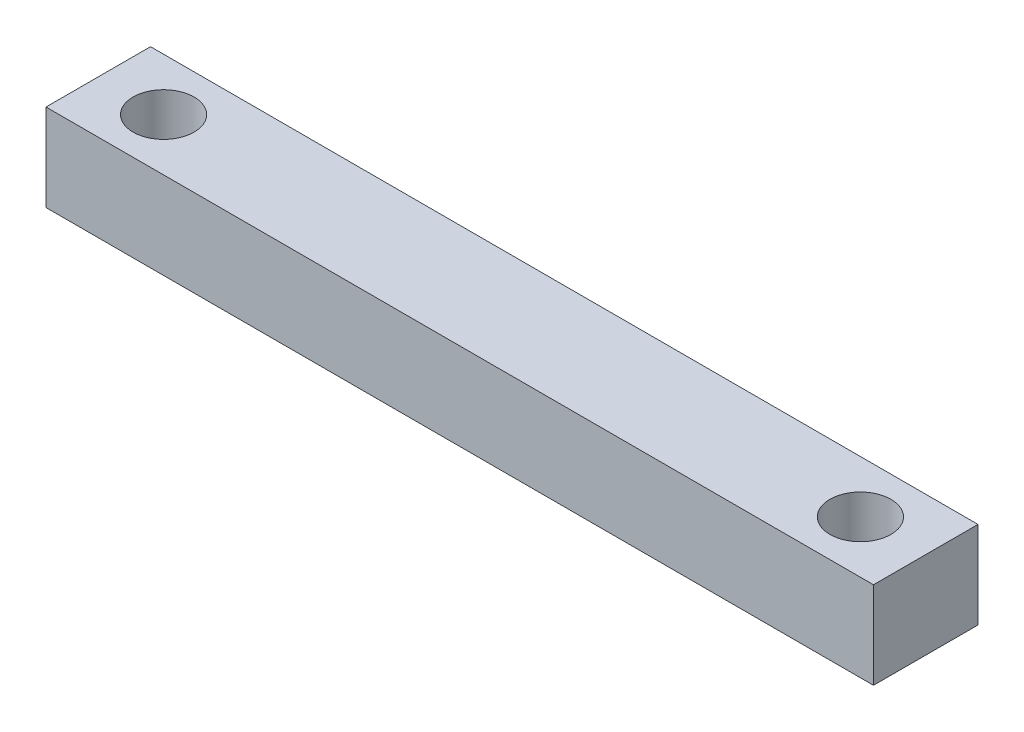
ISO-10303-21;
HEADER;
FILE_DESCRIPTION(('STEP AP214'),'2;1');
FILE_NAME('part.step','',(''),(''),'','','');
FILE_SCHEMA(('AUTOMOTIVE_DESIGN { 1 0 10303 214 1 1 1 1 }'));
ENDSEC;
DATA;
#1=APPLICATION_CONTEXT('core data for automotive mechanical design processes');
#2=APPLICATION_PROTOCOL_DEFINITION('international standard','automotive_design',2000,#1);
#3=PRODUCT_CONTEXT('',#1,'mechanical');
#4=PRODUCT('Part','Part','',(#3));
#5=PRODUCT_RELATED_PRODUCT_CATEGORY('part','',(#4));
#6=PRODUCT_DEFINITION_FORMATION('','',#4);
#7=PRODUCT_DEFINITION_CONTEXT('part definition',#1,'design');
#8=PRODUCT_DEFINITION('design','',#6,#7);
#9=PRODUCT_DEFINITION_SHAPE('','',#8);
#10=(LENGTH_UNIT() NAMED_UNIT(*) SI_UNIT(.MILLI.,.METRE.));
#11=(NAMED_UNIT(*) PLANE_ANGLE_UNIT() SI_UNIT($,.RADIAN.));
#12=(NAMED_UNIT(*) SI_UNIT($,.STERADIAN.) SOLID_ANGLE_UNIT());
#13=UNCERTAINTY_MEASURE_WITH_UNIT(LENGTH_MEASURE(1.E-05),#10,'distance_accuracy_value','');
#14=(GEOMETRIC_REPRESENTATION_CONTEXT(3) GLOBAL_UNCERTAINTY_ASSIGNED_CONTEXT((#13)) GLOBAL_UNIT_ASSIGNED_CONTEXT((#10,
#11,#12)) REPRESENTATION_CONTEXT('',''));
#15=CARTESIAN_POINT('',(0.,0.,0.));
#16=DIRECTION('',(0.,0.,1.));
#17=DIRECTION('',(1.,0.,0.));
#18=AXIS2_PLACEMENT_3D('',#15,#16,#17);
#19=CARTESIAN_POINT('',(0.,5.,0.));
#20=DIRECTION('',(0.,-1.,0.));
#21=DIRECTION('',(0.,0.,-1.));
#22=AXIS2_PLACEMENT_3D('',#19,#20,#21);
#23=PLANE('',#22);
#24=DIRECTION('',(0.,0.,-1.));
#25=VECTOR('',#24,1.);
#26=CARTESIAN_POINT('',(23.75,5.,3.));
#27=LINE('',#26,#25);
#28=CARTESIAN_POINT('',(23.75,5.,3.));
#29=VERTEX_POINT('',#28);
#30=CARTESIAN_POINT('',(23.75,5.,-3.));
#31=VERTEX_POINT('',#30);
#32=EDGE_CURVE('E95',#29,#31,#27,.T.);
#33=ORIENTED_EDGE('',*,*,#32,.T.);
#34=DIRECTION('',(-1.,0.,0.));
#35=VECTOR('',#34,1.);
#36=CARTESIAN_POINT('',(-23.75,5.,-3.));
#37=LINE('',#36,#35);
#38=CARTESIAN_POINT('',(-23.75,5.,-3.));
#39=VERTEX_POINT('',#38);
#40=EDGE_CURVE('E90',#31,#39,#37,.T.);
#41=ORIENTED_EDGE('',*,*,#40,.T.);
#42=DIRECTION('',(0.,0.,1.));
#43=VECTOR('',#42,1.);
#44=CARTESIAN_POINT('',(-23.75,5.,3.));
#45=LINE('',#44,#43);
#46=CARTESIAN_POINT('',(-23.75,5.,3.));
#47=VERTEX_POINT('',#46);
#48=EDGE_CURVE('E93',#39,#47,#45,.T.);
#49=ORIENTED_EDGE('',*,*,#48,.T.);
#50=DIRECTION('',(1.,0.,0.));
#51=VECTOR('',#50,1.);
#52=CARTESIAN_POINT('',(-23.75,5.,3.));
#53=LINE('',#52,#51);
#54=EDGE_CURVE('E60',#47,#29,#53,.T.);
#55=ORIENTED_EDGE('',*,*,#54,.T.);
#56=EDGE_LOOP('',(#33,#41,#49,#55));
#57=FACE_BOUND('',#56,.T.);
#58=CARTESIAN_POINT('',(-20.,5.,0.));
#59=DIRECTION('',(0.,1.,0.));
#60=DIRECTION('',(0.,0.,1.));
#61=AXIS2_PLACEMENT_3D('',#58,#59,#60);
#62=CIRCLE('',#61,1.75);
#63=CARTESIAN_POINT('',(-20.,5.,1.75));
#64=VERTEX_POINT('',#63);
#65=EDGE_CURVE('E117',#64,#64,#62,.T.);
#66=ORIENTED_EDGE('',*,*,#65,.F.);
#67=EDGE_LOOP('',(#66));
#68=FACE_BOUND('',#67,.T.);
#69=CARTESIAN_POINT('',(20.,5.,0.));
#70=DIRECTION('',(0.,1.,0.));
#71=DIRECTION('',(0.,0.,1.));
#72=AXIS2_PLACEMENT_3D('',#69,#70,#71);
#73=CIRCLE('',#72,1.75);
#74=CARTESIAN_POINT('',(20.,5.,1.75));
#75=VERTEX_POINT('',#74);
#76=EDGE_CURVE('E143',#75,#75,#73,.T.);
#77=ORIENTED_EDGE('',*,*,#76,.F.);
#78=EDGE_LOOP('',(#77));
#79=FACE_BOUND('',#78,.T.);
#80=ADVANCED_FACE('F42',(#57,#68,#79),#23,.F.);
#81=CARTESIAN_POINT('',(0.,0.,0.));
#82=DIRECTION('',(0.,-1.,0.));
#83=DIRECTION('',(0.,0.,-1.));
#84=AXIS2_PLACEMENT_3D('',#81,#82,#83);
#85=PLANE('',#84);
#86=CARTESIAN_POINT('',(-20.,0.,0.));
#87=DIRECTION('',(0.,1.,0.));
#88=DIRECTION('',(0.,0.,1.));
#89=AXIS2_PLACEMENT_3D('',#86,#87,#88);
#90=CIRCLE('',#89,1.75);
#91=CARTESIAN_POINT('',(-20.,0.,1.75));
#92=VERTEX_POINT('',#91);
#93=EDGE_CURVE('E139',#92,#92,#90,.T.);
#94=ORIENTED_EDGE('',*,*,#93,.T.);
#95=EDGE_LOOP('',(#94));
#96=FACE_BOUND('',#95,.T.);
#97=DIRECTION('',(0.,0.,-1.));
#98=VECTOR('',#97,1.);
#99=CARTESIAN_POINT('',(23.75,0.,3.));
#100=LINE('',#99,#98);
#101=CARTESIAN_POINT('',(23.75,0.,3.));
#102=VERTEX_POINT('',#101);
#103=CARTESIAN_POINT('',(23.75,0.,-3.));
#104=VERTEX_POINT('',#103);
#105=EDGE_CURVE('E113',#102,#104,#100,.T.);
#106=ORIENTED_EDGE('',*,*,#105,.F.);
#107=DIRECTION('',(1.,0.,0.));
#108=VECTOR('',#107,1.);
#109=CARTESIAN_POINT('',(-23.75,0.,3.));
#110=LINE('',#109,#108);
#111=CARTESIAN_POINT('',(-23.75,0.,3.));
#112=VERTEX_POINT('',#111);
#113=EDGE_CURVE('E83',#112,#102,#110,.T.);
#114=ORIENTED_EDGE('',*,*,#113,.F.);
#115=DIRECTION('',(0.,0.,1.));
#116=VECTOR('',#115,1.);
#117=CARTESIAN_POINT('',(-23.75,0.,3.));
#118=LINE('',#117,#116);
#119=CARTESIAN_POINT('',(-23.75,0.,-3.));
#120=VERTEX_POINT('',#119);
#121=EDGE_CURVE('E77',#120,#112,#118,.T.);
#122=ORIENTED_EDGE('',*,*,#121,.F.);
#123=DIRECTION('',(-1.,0.,0.));
#124=VECTOR('',#123,1.);
#125=CARTESIAN_POINT('',(-23.75,0.,-3.));
#126=LINE('',#125,#124);
#127=EDGE_CURVE('E100',#104,#120,#126,.T.);
#128=ORIENTED_EDGE('',*,*,#127,.F.);
#129=EDGE_LOOP('',(#106,#114,#122,#128));
#130=FACE_BOUND('',#129,.T.);
#131=CARTESIAN_POINT('',(20.,0.,0.));
#132=DIRECTION('',(0.,1.,0.));
#133=DIRECTION('',(0.,0.,1.));
#134=AXIS2_PLACEMENT_3D('',#131,#132,#133);
#135=CIRCLE('',#134,1.75);
#136=CARTESIAN_POINT('',(20.,0.,1.75));
#137=VERTEX_POINT('',#136);
#138=EDGE_CURVE('E147',#137,#137,#135,.T.);
#139=ORIENTED_EDGE('',*,*,#138,.T.);
#140=EDGE_LOOP('',(#139));
#141=FACE_BOUND('',#140,.T.);
#142=ADVANCED_FACE('F132',(#96,#130,#141),#85,.T.);
#143=CARTESIAN_POINT('',(23.75,5.,3.));
#144=DIRECTION('',(-1.,0.,0.));
#145=DIRECTION('',(0.,0.,1.));
#146=AXIS2_PLACEMENT_3D('',#143,#144,#145);
#147=PLANE('',#146);
#148=ORIENTED_EDGE('',*,*,#105,.T.);
#149=DIRECTION('',(0.,-1.,0.));
#150=VECTOR('',#149,1.);
#151=CARTESIAN_POINT('',(23.75,5.,-3.));
#152=LINE('',#151,#150);
#153=EDGE_CURVE('E11',#31,#104,#152,.T.);
#154=ORIENTED_EDGE('',*,*,#153,.F.);
#155=ORIENTED_EDGE('',*,*,#32,.F.);
#156=DIRECTION('',(0.,-1.,0.));
#157=VECTOR('',#156,1.);
#158=CARTESIAN_POINT('',(23.75,5.,3.));
#159=LINE('',#158,#157);
#160=EDGE_CURVE('E109',#29,#102,#159,.T.);
#161=ORIENTED_EDGE('',*,*,#160,.T.);
#162=EDGE_LOOP('',(#148,#154,#155,#161));
#163=FACE_BOUND('',#162,.T.);
#164=ADVANCED_FACE('F44',(#163),#147,.F.);
#165=CARTESIAN_POINT('',(-23.75,5.,-3.));
#166=DIRECTION('',(0.,0.,1.));
#167=DIRECTION('',(1.,0.,0.));
#168=AXIS2_PLACEMENT_3D('',#165,#166,#167);
#169=PLANE('',#168);
#170=ORIENTED_EDGE('',*,*,#127,.T.);
#171=DIRECTION('',(0.,-1.,0.));
#172=VECTOR('',#171,1.);
#173=CARTESIAN_POINT('',(-23.75,5.,-3.));
#174=LINE('',#173,#172);
#175=EDGE_CURVE('E52',#39,#120,#174,.T.);
#176=ORIENTED_EDGE('',*,*,#175,.F.);
#177=ORIENTED_EDGE('',*,*,#40,.F.);
#178=ORIENTED_EDGE('',*,*,#153,.T.);
#179=EDGE_LOOP('',(#170,#176,#177,#178));
#180=FACE_BOUND('',#179,.T.);
#181=ADVANCED_FACE('F99',(#180),#169,.F.);
#182=CARTESIAN_POINT('',(-23.75,5.,3.));
#183=DIRECTION('',(1.,0.,0.));
#184=DIRECTION('',(0.,0.,-1.));
#185=AXIS2_PLACEMENT_3D('',#182,#183,#184);
#186=PLANE('',#185);
#187=ORIENTED_EDGE('',*,*,#121,.T.);
#188=DIRECTION('',(0.,-1.,0.));
#189=VECTOR('',#188,1.);
#190=CARTESIAN_POINT('',(-23.75,5.,3.));
#191=LINE('',#190,#189);
#192=EDGE_CURVE('E102',#47,#112,#191,.T.);
#193=ORIENTED_EDGE('',*,*,#192,.F.);
#194=ORIENTED_EDGE('',*,*,#48,.F.);
#195=ORIENTED_EDGE('',*,*,#175,.T.);
#196=EDGE_LOOP('',(#187,#193,#194,#195));
#197=FACE_BOUND('',#196,.T.);
#198=ADVANCED_FACE('F103',(#197),#186,.F.);
#199=CARTESIAN_POINT('',(-23.75,5.,3.));
#200=DIRECTION('',(0.,0.,-1.));
#201=DIRECTION('',(-1.,0.,0.));
#202=AXIS2_PLACEMENT_3D('',#199,#200,#201);
#203=PLANE('',#202);
#204=ORIENTED_EDGE('',*,*,#113,.T.);
#205=ORIENTED_EDGE('',*,*,#160,.F.);
#206=ORIENTED_EDGE('',*,*,#54,.F.);
#207=ORIENTED_EDGE('',*,*,#192,.T.);
#208=EDGE_LOOP('',(#204,#205,#206,#207));
#209=FACE_BOUND('',#208,.T.);
#210=ADVANCED_FACE('F129',(#209),#203,.F.);
#211=CARTESIAN_POINT('',(-20.,5.,0.));
#212=DIRECTION('',(0.,-1.,0.));
#213=DIRECTION('',(0.,0.,-1.));
#214=AXIS2_PLACEMENT_3D('',#211,#212,#213);
#215=CYLINDRICAL_SURFACE('',#214,1.75);
#216=ORIENTED_EDGE('',*,*,#65,.T.);
#217=EDGE_LOOP('',(#216));
#218=FACE_BOUND('',#217,.T.);
#219=ORIENTED_EDGE('',*,*,#93,.F.);
#220=EDGE_LOOP('',(#219));
#221=FACE_BOUND('',#220,.T.);
#222=ADVANCED_FACE('F168',(#218,#221),#215,.F.);
#223=CARTESIAN_POINT('',(20.,5.,0.));
#224=DIRECTION('',(0.,-1.,0.));
#225=DIRECTION('',(0.,0.,-1.));
#226=AXIS2_PLACEMENT_3D('',#223,#224,#225);
#227=CYLINDRICAL_SURFACE('',#226,1.75);
#228=ORIENTED_EDGE('',*,*,#76,.T.);
#229=EDGE_LOOP('',(#228));
#230=FACE_BOUND('',#229,.T.);
#231=ORIENTED_EDGE('',*,*,#138,.F.);
#232=EDGE_LOOP('',(#231));
#233=FACE_BOUND('',#232,.T.);
#234=ADVANCED_FACE('F157',(#230,#233),#227,.F.);
#235=CLOSED_SHELL('',(#80,#142,#164,#181,#198,#210,#222,#234));
#236=MANIFOLD_SOLID_BREP('B2',#235);
#237=ADVANCED_BREP_SHAPE_REPRESENTATION('',(#18,#236),#14);
#238=SHAPE_DEFINITION_REPRESENTATION(#9,#237);
ENDSEC;
END-ISO-10303-21;
